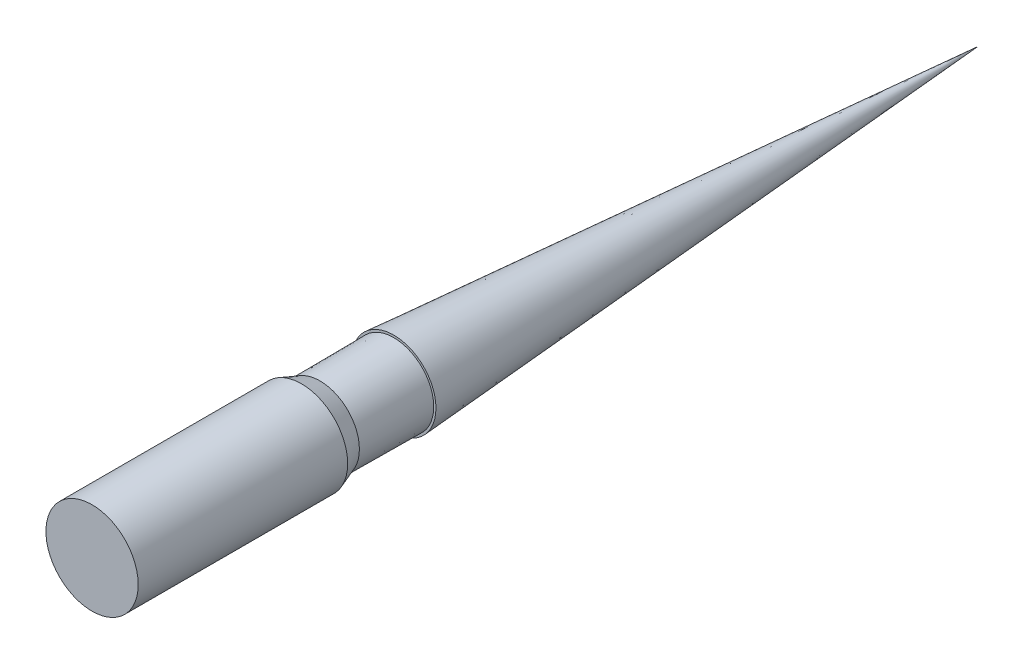
ISO-10303-21;
HEADER;
FILE_DESCRIPTION(('STEP AP214'),'2;1');
FILE_NAME('part.step','',(''),(''),'','','');
FILE_SCHEMA(('AUTOMOTIVE_DESIGN { 1 0 10303 214 1 1 1 1 }'));
ENDSEC;
DATA;
#1=APPLICATION_CONTEXT('core data for automotive mechanical design processes');
#2=APPLICATION_PROTOCOL_DEFINITION('international standard','automotive_design',2000,#1);
#3=PRODUCT_CONTEXT('',#1,'mechanical');
#4=PRODUCT('Part','Part','',(#3));
#5=PRODUCT_RELATED_PRODUCT_CATEGORY('part','',(#4));
#6=PRODUCT_DEFINITION_FORMATION('','',#4);
#7=PRODUCT_DEFINITION_CONTEXT('part definition',#1,'design');
#8=PRODUCT_DEFINITION('design','',#6,#7);
#9=PRODUCT_DEFINITION_SHAPE('','',#8);
#10=(LENGTH_UNIT() NAMED_UNIT(*) SI_UNIT(.MILLI.,.METRE.));
#11=(NAMED_UNIT(*) PLANE_ANGLE_UNIT() SI_UNIT($,.RADIAN.));
#12=(NAMED_UNIT(*) SI_UNIT($,.STERADIAN.) SOLID_ANGLE_UNIT());
#13=UNCERTAINTY_MEASURE_WITH_UNIT(LENGTH_MEASURE(1.E-05),#10,'distance_accuracy_value','');
#14=(GEOMETRIC_REPRESENTATION_CONTEXT(3) GLOBAL_UNCERTAINTY_ASSIGNED_CONTEXT((#13)) GLOBAL_UNIT_ASSIGNED_CONTEXT((#10,
#11,#12)) REPRESENTATION_CONTEXT('',''));
#15=CARTESIAN_POINT('',(0.,0.,0.));
#16=DIRECTION('',(0.,0.,1.));
#17=DIRECTION('',(1.,0.,0.));
#18=AXIS2_PLACEMENT_3D('',#15,#16,#17);
#19=CARTESIAN_POINT('',(0.,0.,304.8));
#20=DIRECTION('',(0.,0.,-1.));
#21=DIRECTION('',(-1.,0.,0.));
#22=AXIS2_PLACEMENT_3D('',#19,#20,#21);
#23=CYLINDRICAL_SURFACE('',#22,15.875);
#24=CARTESIAN_POINT('',(0.,0.,304.8));
#25=DIRECTION('',(0.,0.,1.));
#26=DIRECTION('',(1.,0.,0.));
#27=AXIS2_PLACEMENT_3D('',#24,#25,#26);
#28=CIRCLE('',#27,15.875);
#29=CARTESIAN_POINT('',(15.875,0.,304.8));
#30=VERTEX_POINT('',#29);
#31=EDGE_CURVE('E11',#30,#30,#28,.T.);
#32=ORIENTED_EDGE('',*,*,#31,.F.);
#33=EDGE_LOOP('',(#32));
#34=FACE_BOUND('',#33,.T.);
#35=CARTESIAN_POINT('',(0.,0.,232.7402));
#36=DIRECTION('',(0.,0.,1.));
#37=DIRECTION('',(1.,0.,0.));
#38=AXIS2_PLACEMENT_3D('',#35,#36,#37);
#39=CIRCLE('',#38,15.875);
#40=CARTESIAN_POINT('',(15.875,0.,232.7402));
#41=VERTEX_POINT('',#40);
#42=EDGE_CURVE('E41',#41,#41,#39,.T.);
#43=ORIENTED_EDGE('',*,*,#42,.T.);
#44=EDGE_LOOP('',(#43));
#45=FACE_BOUND('',#44,.T.);
#46=ADVANCED_FACE('F35',(#34,#45),#23,.T.);
#47=CARTESIAN_POINT('',(0.,0.,304.8));
#48=DIRECTION('',(0.,0.,1.));
#49=DIRECTION('',(1.,0.,0.));
#50=AXIS2_PLACEMENT_3D('',#47,#48,#49);
#51=PLANE('',#50);
#52=ORIENTED_EDGE('',*,*,#31,.T.);
#53=EDGE_LOOP('',(#52));
#54=FACE_BOUND('',#53,.T.);
#55=ADVANCED_FACE('F67',(#54),#51,.T.);
#56=CARTESIAN_POINT('',(0.,0.,232.7402));
#57=DIRECTION('',(0.,0.,1.));
#58=DIRECTION('',(1.,0.,0.));
#59=AXIS2_PLACEMENT_3D('',#56,#57,#58);
#60=CONICAL_SURFACE('',#59,15.875,0.349092133951802);
#61=CARTESIAN_POINT('',(0.,0.,226.3902));
#62=DIRECTION('',(0.,0.,1.));
#63=DIRECTION('',(1.,0.,0.));
#64=AXIS2_PLACEMENT_3D('',#61,#62,#63);
#65=CIRCLE('',#64,13.5636);
#66=CARTESIAN_POINT('',(13.5636,0.,226.3902));
#67=VERTEX_POINT('',#66);
#68=EDGE_CURVE('E56',#67,#67,#65,.T.);
#69=ORIENTED_EDGE('',*,*,#68,.T.);
#70=EDGE_LOOP('',(#69));
#71=FACE_BOUND('',#70,.T.);
#72=ORIENTED_EDGE('',*,*,#42,.F.);
#73=EDGE_LOOP('',(#72));
#74=FACE_BOUND('',#73,.T.);
#75=ADVANCED_FACE('F64',(#71,#74),#60,.T.);
#76=CARTESIAN_POINT('',(0.,0.,226.3902));
#77=DIRECTION('',(0.,0.,-1.));
#78=DIRECTION('',(-1.,0.,0.));
#79=AXIS2_PLACEMENT_3D('',#76,#77,#78);
#80=CONICAL_SURFACE('',#79,13.5636,0.0069998856700279);
#81=CARTESIAN_POINT('',(0.,0.,200.9902));
#82=DIRECTION('',(0.,0.,1.));
#83=DIRECTION('',(1.,0.,0.));
#84=AXIS2_PLACEMENT_3D('',#81,#82,#83);
#85=CIRCLE('',#84,13.7414);
#86=CARTESIAN_POINT('',(13.7414,0.,200.9902));
#87=VERTEX_POINT('',#86);
#88=EDGE_CURVE('E53',#87,#87,#85,.T.);
#89=ORIENTED_EDGE('',*,*,#88,.T.);
#90=EDGE_LOOP('',(#89));
#91=FACE_BOUND('',#90,.T.);
#92=ORIENTED_EDGE('',*,*,#68,.F.);
#93=EDGE_LOOP('',(#92));
#94=FACE_BOUND('',#93,.T.);
#95=ADVANCED_FACE('F66',(#91,#94),#80,.T.);
#96=CARTESIAN_POINT('',(0.,14.5034,200.9902));
#97=DIRECTION('',(0.,0.,1.));
#98=DIRECTION('',(1.,0.,0.));
#99=AXIS2_PLACEMENT_3D('',#96,#97,#98);
#100=PLANE('',#99);
#101=CARTESIAN_POINT('',(0.,0.,200.9902));
#102=DIRECTION('',(0.,0.,1.));
#103=DIRECTION('',(1.,0.,0.));
#104=AXIS2_PLACEMENT_3D('',#101,#102,#103);
#105=CIRCLE('',#104,14.5034);
#106=CARTESIAN_POINT('',(14.5034,0.,200.9902));
#107=VERTEX_POINT('',#106);
#108=EDGE_CURVE('E51',#107,#107,#105,.T.);
#109=ORIENTED_EDGE('',*,*,#108,.T.);
#110=EDGE_LOOP('',(#109));
#111=FACE_BOUND('',#110,.T.);
#112=ORIENTED_EDGE('',*,*,#88,.F.);
#113=EDGE_LOOP('',(#112));
#114=FACE_BOUND('',#113,.T.);
#115=ADVANCED_FACE('F47',(#111,#114),#100,.T.);
#116=CARTESIAN_POINT('',(0.,0.,200.9902));
#117=DIRECTION('',(0.,0.,1.));
#118=DIRECTION('',(1.,0.,0.));
#119=AXIS2_PLACEMENT_3D('',#116,#117,#118);
#120=CONICAL_SURFACE('',#119,14.5034,0.0720348810714557);
#121=CARTESIAN_POINT('',(0.,0.,0.));
#122=VERTEX_POINT('',#121);
#123=VERTEX_LOOP('',#122);
#124=FACE_BOUND('',#123,.T.);
#125=ORIENTED_EDGE('',*,*,#108,.F.);
#126=EDGE_LOOP('',(#125));
#127=FACE_BOUND('',#126,.T.);
#128=ADVANCED_FACE('F44',(#124,#127),#120,.T.);
#129=CLOSED_SHELL('',(#46,#55,#75,#95,#115,#128));
#130=MANIFOLD_SOLID_BREP('B2',#129);
#131=ADVANCED_BREP_SHAPE_REPRESENTATION('',(#18,#130),#14);
#132=SHAPE_DEFINITION_REPRESENTATION(#9,#131);
ENDSEC;
END-ISO-10303-21;
